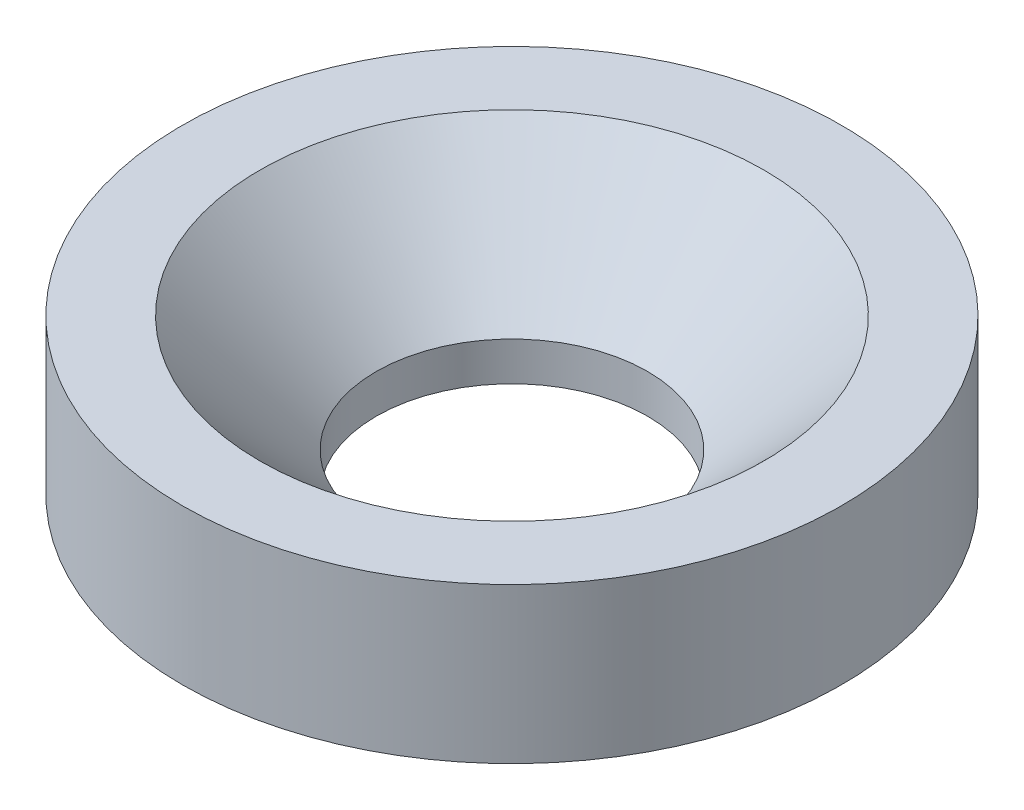
ISO-10303-21;
HEADER;
FILE_DESCRIPTION(('STEP AP214'),'2;1');
FILE_NAME('part.step','',(''),(''),'','','');
FILE_SCHEMA(('AUTOMOTIVE_DESIGN { 1 0 10303 214 1 1 1 1 }'));
ENDSEC;
DATA;
#1=APPLICATION_CONTEXT('core data for automotive mechanical design processes');
#2=APPLICATION_PROTOCOL_DEFINITION('international standard','automotive_design',2000,#1);
#3=PRODUCT_CONTEXT('',#1,'mechanical');
#4=PRODUCT('Part','Part','',(#3));
#5=PRODUCT_RELATED_PRODUCT_CATEGORY('part','',(#4));
#6=PRODUCT_DEFINITION_FORMATION('','',#4);
#7=PRODUCT_DEFINITION_CONTEXT('part definition',#1,'design');
#8=PRODUCT_DEFINITION('design','',#6,#7);
#9=PRODUCT_DEFINITION_SHAPE('','',#8);
#10=(LENGTH_UNIT() NAMED_UNIT(*) SI_UNIT(.MILLI.,.METRE.));
#11=(NAMED_UNIT(*) PLANE_ANGLE_UNIT() SI_UNIT($,.RADIAN.));
#12=(NAMED_UNIT(*) SI_UNIT($,.STERADIAN.) SOLID_ANGLE_UNIT());
#13=UNCERTAINTY_MEASURE_WITH_UNIT(LENGTH_MEASURE(1.E-05),#10,'distance_accuracy_value','');
#14=(GEOMETRIC_REPRESENTATION_CONTEXT(3) GLOBAL_UNCERTAINTY_ASSIGNED_CONTEXT((#13)) GLOBAL_UNIT_ASSIGNED_CONTEXT((#10,
#11,#12)) REPRESENTATION_CONTEXT('',''));
#15=CARTESIAN_POINT('',(0.,0.,0.));
#16=DIRECTION('',(0.,0.,1.));
#17=DIRECTION('',(1.,0.,0.));
#18=AXIS2_PLACEMENT_3D('',#15,#16,#17);
#19=CARTESIAN_POINT('',(0.,2.,0.));
#20=DIRECTION('',(0.,1.,0.));
#21=DIRECTION('',(0.,0.,1.));
#22=AXIS2_PLACEMENT_3D('',#19,#20,#21);
#23=PLANE('',#22);
#24=CARTESIAN_POINT('',(0.,2.,0.));
#25=DIRECTION('',(0.,1.,0.));
#26=DIRECTION('',(0.,0.,1.));
#27=AXIS2_PLACEMENT_3D('',#24,#25,#26);
#28=CIRCLE('',#27,3.25);
#29=CARTESIAN_POINT('',(0.,2.,3.25));
#30=VERTEX_POINT('',#29);
#31=EDGE_CURVE('E10',#30,#30,#28,.F.);
#32=ORIENTED_EDGE('',*,*,#31,.T.);
#33=EDGE_LOOP('',(#32));
#34=FACE_BOUND('',#33,.T.);
#35=CARTESIAN_POINT('',(0.,2.,0.));
#36=DIRECTION('',(0.,1.,0.));
#37=DIRECTION('',(0.,0.,1.));
#38=AXIS2_PLACEMENT_3D('',#35,#36,#37);
#39=CIRCLE('',#38,4.25);
#40=CARTESIAN_POINT('',(0.,2.,4.25));
#41=VERTEX_POINT('',#40);
#42=EDGE_CURVE('E50',#41,#41,#39,.T.);
#43=ORIENTED_EDGE('',*,*,#42,.T.);
#44=EDGE_LOOP('',(#43));
#45=FACE_BOUND('',#44,.T.);
#46=ADVANCED_FACE('F37',(#34,#45),#23,.T.);
#47=CARTESIAN_POINT('',(0.,0.,0.));
#48=DIRECTION('',(0.,1.,0.));
#49=DIRECTION('',(0.,0.,1.));
#50=AXIS2_PLACEMENT_3D('',#47,#48,#49);
#51=PLANE('',#50);
#52=CARTESIAN_POINT('',(0.,0.,0.));
#53=DIRECTION('',(0.,1.,0.));
#54=DIRECTION('',(0.,0.,1.));
#55=AXIS2_PLACEMENT_3D('',#52,#53,#54);
#56=CIRCLE('',#55,4.25);
#57=CARTESIAN_POINT('',(0.,0.,4.25));
#58=VERTEX_POINT('',#57);
#59=EDGE_CURVE('E55',#58,#58,#56,.T.);
#60=ORIENTED_EDGE('',*,*,#59,.F.);
#61=EDGE_LOOP('',(#60));
#62=FACE_BOUND('',#61,.T.);
#63=CARTESIAN_POINT('',(0.,0.,0.));
#64=DIRECTION('',(0.,1.,0.));
#65=DIRECTION('',(0.,0.,1.));
#66=AXIS2_PLACEMENT_3D('',#63,#64,#65);
#67=CIRCLE('',#66,1.75);
#68=CARTESIAN_POINT('',(0.,0.,1.75));
#69=VERTEX_POINT('',#68);
#70=EDGE_CURVE('E60',#69,#69,#67,.T.);
#71=ORIENTED_EDGE('',*,*,#70,.T.);
#72=EDGE_LOOP('',(#71));
#73=FACE_BOUND('',#72,.T.);
#74=ADVANCED_FACE('F66',(#62,#73),#51,.F.);
#75=CARTESIAN_POINT('',(0.,2.,0.));
#76=DIRECTION('',(0.,-1.,0.));
#77=DIRECTION('',(0.,0.,-1.));
#78=AXIS2_PLACEMENT_3D('',#75,#76,#77);
#79=CYLINDRICAL_SURFACE('',#78,4.25);
#80=ORIENTED_EDGE('',*,*,#42,.F.);
#81=EDGE_LOOP('',(#80));
#82=FACE_BOUND('',#81,.T.);
#83=ORIENTED_EDGE('',*,*,#59,.T.);
#84=EDGE_LOOP('',(#83));
#85=FACE_BOUND('',#84,.T.);
#86=ADVANCED_FACE('F70',(#82,#85),#79,.T.);
#87=CARTESIAN_POINT('',(0.,2.,0.));
#88=DIRECTION('',(0.,-1.,0.));
#89=DIRECTION('',(0.,0.,-1.));
#90=AXIS2_PLACEMENT_3D('',#87,#88,#89);
#91=CYLINDRICAL_SURFACE('',#90,1.75);
#92=CARTESIAN_POINT('',(0.,0.500000000000002,0.));
#93=DIRECTION('',(0.,1.,0.));
#94=DIRECTION('',(0.,0.,1.));
#95=AXIS2_PLACEMENT_3D('',#92,#93,#94);
#96=CIRCLE('',#95,1.75);
#97=CARTESIAN_POINT('',(0.,0.500000000000002,1.75));
#98=VERTEX_POINT('',#97);
#99=EDGE_CURVE('E45',#98,#98,#96,.T.);
#100=ORIENTED_EDGE('',*,*,#99,.T.);
#101=EDGE_LOOP('',(#100));
#102=FACE_BOUND('',#101,.T.);
#103=ORIENTED_EDGE('',*,*,#70,.F.);
#104=EDGE_LOOP('',(#103));
#105=FACE_BOUND('',#104,.T.);
#106=ADVANCED_FACE('F68',(#102,#105),#91,.F.);
#107=CARTESIAN_POINT('',(0.,0.500000000000002,0.));
#108=DIRECTION('',(0.,1.,0.));
#109=DIRECTION('',(0.,0.,1.));
#110=AXIS2_PLACEMENT_3D('',#107,#108,#109);
#111=CONICAL_SURFACE('',#110,1.75,0.78539816339745);
#112=ORIENTED_EDGE('',*,*,#31,.F.);
#113=EDGE_LOOP('',(#112));
#114=FACE_BOUND('',#113,.T.);
#115=ORIENTED_EDGE('',*,*,#99,.F.);
#116=EDGE_LOOP('',(#115));
#117=FACE_BOUND('',#116,.T.);
#118=ADVANCED_FACE('F39',(#114,#117),#111,.F.);
#119=CLOSED_SHELL('',(#46,#74,#86,#106,#118));
#120=MANIFOLD_SOLID_BREP('B2',#119);
#121=ADVANCED_BREP_SHAPE_REPRESENTATION('',(#18,#120),#14);
#122=SHAPE_DEFINITION_REPRESENTATION(#9,#121);
ENDSEC;
END-ISO-10303-21;
